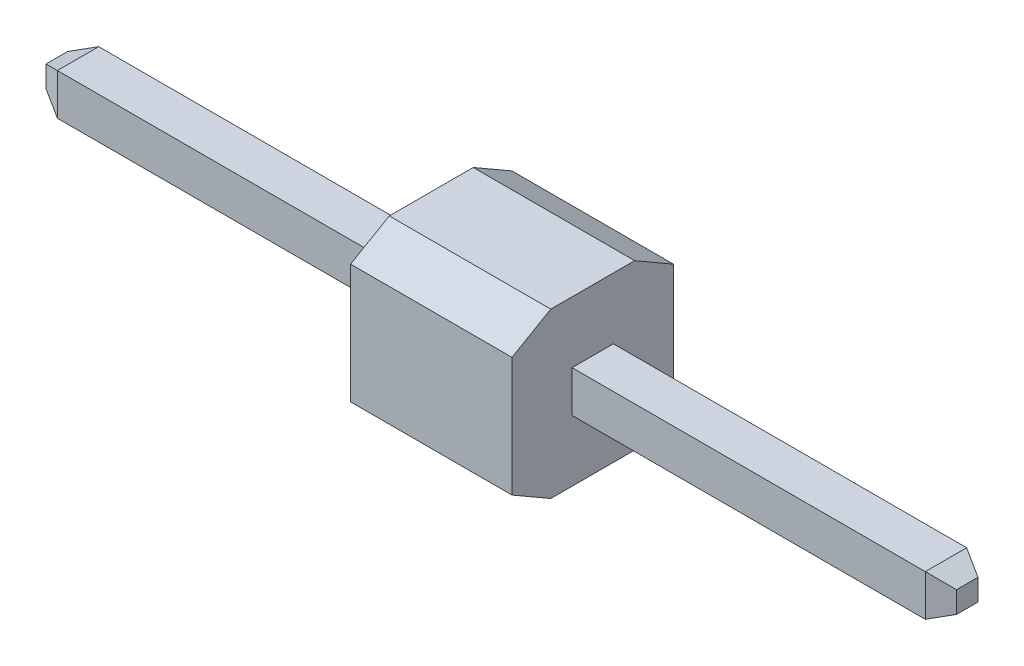
ISO-10303-21;
HEADER;
FILE_DESCRIPTION(('STEP AP214'),'2;1');
FILE_NAME('part.step','',(''),(''),'','','');
FILE_SCHEMA(('AUTOMOTIVE_DESIGN { 1 0 10303 214 1 1 1 1 }'));
ENDSEC;
DATA;
#1=APPLICATION_CONTEXT('core data for automotive mechanical design processes');
#2=APPLICATION_PROTOCOL_DEFINITION('international standard','automotive_design',2000,#1);
#3=PRODUCT_CONTEXT('',#1,'mechanical');
#4=PRODUCT('Part','Part','',(#3));
#5=PRODUCT_RELATED_PRODUCT_CATEGORY('part','',(#4));
#6=PRODUCT_DEFINITION_FORMATION('','',#4);
#7=PRODUCT_DEFINITION_CONTEXT('part definition',#1,'design');
#8=PRODUCT_DEFINITION('design','',#6,#7);
#9=PRODUCT_DEFINITION_SHAPE('','',#8);
#10=(LENGTH_UNIT() NAMED_UNIT(*) SI_UNIT(.MILLI.,.METRE.));
#11=(NAMED_UNIT(*) PLANE_ANGLE_UNIT() SI_UNIT($,.RADIAN.));
#12=(NAMED_UNIT(*) SI_UNIT($,.STERADIAN.) SOLID_ANGLE_UNIT());
#13=UNCERTAINTY_MEASURE_WITH_UNIT(LENGTH_MEASURE(1.E-05),#10,'distance_accuracy_value','');
#14=(GEOMETRIC_REPRESENTATION_CONTEXT(3) GLOBAL_UNCERTAINTY_ASSIGNED_CONTEXT((#13)) GLOBAL_UNIT_ASSIGNED_CONTEXT((#10,
#11,#12)) REPRESENTATION_CONTEXT('',''));
#15=CARTESIAN_POINT('',(0.,0.,0.));
#16=DIRECTION('',(0.,0.,1.));
#17=DIRECTION('',(1.,0.,0.));
#18=AXIS2_PLACEMENT_3D('',#15,#16,#17);
#19=CARTESIAN_POINT('',(5.42110044765887,0.317115726057139,-2.77112059556477));
#20=DIRECTION('',(1.,-9.93476518829084E-08,4.37113882867379E-08));
#21=DIRECTION('',(-9.93476589883358E-08,-1.,8.74227765734759E-08));
#22=AXIS2_PLACEMENT_3D('',#19,#20,#21);
#23=PLANE('',#22);
#24=DIRECTION('',(-1.18186632779335E-08,-0.50000007571054,-0.866025360072934));
#25=VECTOR('',#24,1.);
#26=CARTESIAN_POINT('',(5.42110025548426,-0.926473975179089,-1.20112048684669));
#27=LINE('',#26,#25);
#28=CARTESIAN_POINT('',(5.42110025548426,-0.926473975179089,-1.20112048684669));
#29=VERTEX_POINT('',#28);
#30=CARTESIAN_POINT('',(5.42110024729606,-1.27288418914276,-1.80112045656255));
#31=VERTEX_POINT('',#30);
#32=EDGE_CURVE('E11',#29,#31,#27,.T.);
#33=ORIENTED_EDGE('',*,*,#32,.T.);
#34=DIRECTION('',(4.37113811813104E-08,-8.74227828590458E-08,-0.999999999999995));
#35=VECTOR('',#34,1.);
#36=CARTESIAN_POINT('',(5.42110024729606,-1.27288418914276,-1.80112045656255));
#37=LINE('',#36,#35);
#38=CARTESIAN_POINT('',(5.42110030412085,-1.27288430279238,-3.10112045656255));
#39=VERTEX_POINT('',#38);
#40=EDGE_CURVE('E304',#31,#39,#37,.T.);
#41=ORIENTED_EDGE('',*,*,#40,.T.);
#42=DIRECTION('',(8.75289963531794E-08,0.499999924289837,-0.866025447495713));
#43=VECTOR('',#42,1.);
#44=CARTESIAN_POINT('',(5.42110030412085,-1.27288430279238,-3.10112045656255));
#45=LINE('',#44,#43);
#46=CARTESIAN_POINT('',(5.42110036476272,-0.926474193736048,-3.70112048684669));
#47=VERTEX_POINT('',#46);
#48=EDGE_CURVE('E296',#39,#47,#45,.T.);
#49=ORIENTED_EDGE('',*,*,#48,.T.);
#50=DIRECTION('',(9.93476588436478E-08,0.999999999999991,-8.74227767226935E-08));
#51=VECTOR('',#50,1.);
#52=CARTESIAN_POINT('',(5.42110036476272,-0.926474193736048,-3.70112048684669));
#53=LINE('',#52,#51);
#54=CARTESIAN_POINT('',(5.42110054827569,0.920705483233952,-3.70112064833227));
#55=VERTEX_POINT('',#54);
#56=EDGE_CURVE('E281',#47,#55,#53,.T.);
#57=ORIENTED_EDGE('',*,*,#56,.T.);
#58=DIRECTION('',(-1.18186632778483E-08,-0.500000075710537,-0.866025360072935));
#59=VECTOR('',#58,1.);
#60=CARTESIAN_POINT('',(5.4211005564639,1.26711569720762,-3.1011206786164));
#61=LINE('',#60,#59);
#62=CARTESIAN_POINT('',(5.4211005564639,1.26711569720762,-3.1011206786164));
#63=VERTEX_POINT('',#62);
#64=EDGE_CURVE('E265',#63,#55,#61,.T.);
#65=ORIENTED_EDGE('',*,*,#64,.F.);
#66=DIRECTION('',(4.37113811813104E-08,-8.74227828590458E-08,-0.999999999999995));
#67=VECTOR('',#66,1.);
#68=CARTESIAN_POINT('',(5.42110049963911,1.26711581085724,-1.8011206786164));
#69=LINE('',#68,#67);
#70=CARTESIAN_POINT('',(5.42110049963911,1.26711581085724,-1.8011206786164));
#71=VERTEX_POINT('',#70);
#72=EDGE_CURVE('E248',#71,#63,#69,.T.);
#73=ORIENTED_EDGE('',*,*,#72,.F.);
#74=DIRECTION('',(8.75289963525479E-08,0.499999924289836,-0.866025447495713));
#75=VECTOR('',#74,1.);
#76=CARTESIAN_POINT('',(5.42110043899724,0.920705701790911,-1.20112064833227));
#77=LINE('',#76,#75);
#78=CARTESIAN_POINT('',(5.42110043899724,0.920705701790911,-1.20112064833227));
#79=VERTEX_POINT('',#78);
#80=EDGE_CURVE('E242',#79,#71,#77,.T.);
#81=ORIENTED_EDGE('',*,*,#80,.F.);
#82=DIRECTION('',(9.93476588436478E-08,0.999999999999991,-8.7422776241864E-08));
#83=VECTOR('',#82,1.);
#84=CARTESIAN_POINT('',(5.42110025548426,-0.926473975179089,-1.20112048684669));
#85=LINE('',#84,#83);
#86=EDGE_CURVE('E236',#29,#79,#85,.T.);
#87=ORIENTED_EDGE('',*,*,#86,.F.);
#88=EDGE_LOOP('',(#33,#41,#49,#57,#65,#73,#81,#87));
#89=FACE_BOUND('',#88,.T.);
#90=DIRECTION('',(-4.37113803486431E-08,8.74227829017466E-08,0.999999999999995));
#91=VECTOR('',#90,1.);
#92=CARTESIAN_POINT('',(5.42110038407637,-0.32288427394286,-2.77112053961419));
#93=LINE('',#92,#91);
#94=CARTESIAN_POINT('',(5.42110038407637,-0.32288427394286,-2.77112053961419));
#95=VERTEX_POINT('',#94);
#96=CARTESIAN_POINT('',(5.42110035610109,-0.322884217992279,-2.13112053961419));
#97=VERTEX_POINT('',#96);
#98=EDGE_CURVE('E302',#95,#97,#93,.T.);
#99=ORIENTED_EDGE('',*,*,#98,.T.);
#100=DIRECTION('',(-9.93476578781121E-08,-0.999999999999991,8.7422776656742E-08));
#101=VECTOR('',#100,1.);
#102=CARTESIAN_POINT('',(5.42110041968359,0.31711578200772,-2.13112059556477));
#103=LINE('',#102,#101);
#104=CARTESIAN_POINT('',(5.42110041968359,0.31711578200772,-2.13112059556477));
#105=VERTEX_POINT('',#104);
#106=EDGE_CURVE('E293',#105,#97,#103,.T.);
#107=ORIENTED_EDGE('',*,*,#106,.F.);
#108=DIRECTION('',(-4.37113817364219E-08,8.74227829017467E-08,0.999999999999995));
#109=VECTOR('',#108,1.);
#110=CARTESIAN_POINT('',(5.42110044765887,0.317115726057139,-2.77112059556477));
#111=LINE('',#110,#109);
#112=CARTESIAN_POINT('',(5.42110044765887,0.317115726057139,-2.77112059556477));
#113=VERTEX_POINT('',#112);
#114=EDGE_CURVE('E278',#113,#105,#111,.T.);
#115=ORIENTED_EDGE('',*,*,#114,.F.);
#116=DIRECTION('',(-9.93476592658908E-08,-0.999999999999991,8.74227759628526E-08));
#117=VECTOR('',#116,1.);
#118=CARTESIAN_POINT('',(5.42110044765887,0.317115726057139,-2.77112059556477));
#119=LINE('',#118,#117);
#120=EDGE_CURVE('E263',#113,#95,#119,.T.);
#121=ORIENTED_EDGE('',*,*,#120,.T.);
#122=EDGE_LOOP('',(#99,#107,#115,#121));
#123=FACE_BOUND('',#122,.T.);
#124=ADVANCED_FACE('F17',(#89,#123),#23,.T.);
#125=CARTESIAN_POINT('',(2.92110044765887,0.317115974426269,-2.77112070484324));
#126=DIRECTION('',(1.,-9.93476518829084E-08,4.37113882867379E-08));
#127=DIRECTION('',(-9.93476589883358E-08,-1.,8.74227765734759E-08));
#128=AXIS2_PLACEMENT_3D('',#125,#126,#127);
#129=PLANE('',#128);
#130=DIRECTION('',(-1.1818662636946E-08,-0.50000007571054,-0.866025360072934));
#131=VECTOR('',#130,1.);
#132=CARTESIAN_POINT('',(2.92110025548427,-0.926473726809959,-1.20112059612516));
#133=LINE('',#132,#131);
#134=CARTESIAN_POINT('',(2.92110025548427,-0.926473726809959,-1.20112059612516));
#135=VERTEX_POINT('',#134);
#136=CARTESIAN_POINT('',(2.92110024729606,-1.27288394077363,-1.80112056584102));
#137=VERTEX_POINT('',#136);
#138=EDGE_CURVE('E24',#135,#137,#133,.T.);
#139=ORIENTED_EDGE('',*,*,#138,.F.);
#140=DIRECTION('',(9.93476590840625E-08,0.999999999999991,-8.7422776241864E-08));
#141=VECTOR('',#140,1.);
#142=CARTESIAN_POINT('',(2.92110025548427,-0.926473726809959,-1.20112059612516));
#143=LINE('',#142,#141);
#144=CARTESIAN_POINT('',(2.92110043899724,0.920705950160041,-1.20112075761074));
#145=VERTEX_POINT('',#144);
#146=EDGE_CURVE('E300',#135,#145,#143,.T.);
#147=ORIENTED_EDGE('',*,*,#146,.T.);
#148=DIRECTION('',(8.75289957115603E-08,0.499999924289836,-0.866025447495713));
#149=VECTOR('',#148,1.);
#150=CARTESIAN_POINT('',(2.92110043899724,0.920705950160041,-1.20112075761074));
#151=LINE('',#150,#149);
#152=CARTESIAN_POINT('',(2.92110049963911,1.26711605922637,-1.80112078789487));
#153=VERTEX_POINT('',#152);
#154=EDGE_CURVE('E286',#145,#153,#151,.T.);
#155=ORIENTED_EDGE('',*,*,#154,.T.);
#156=DIRECTION('',(4.37113811813104E-08,-8.74227828590458E-08,-0.999999999999995));
#157=VECTOR('',#156,1.);
#158=CARTESIAN_POINT('',(2.92110049963911,1.26711605922637,-1.80112078789487));
#159=LINE('',#158,#157);
#160=CARTESIAN_POINT('',(2.9211005564639,1.26711594557675,-3.10112078789487));
#161=VERTEX_POINT('',#160);
#162=EDGE_CURVE('E271',#153,#161,#159,.T.);
#163=ORIENTED_EDGE('',*,*,#162,.T.);
#164=DIRECTION('',(-1.18186626368607E-08,-0.500000075710537,-0.866025360072935));
#165=VECTOR('',#164,1.);
#166=CARTESIAN_POINT('',(2.9211005564639,1.26711594557675,-3.10112078789487));
#167=LINE('',#166,#165);
#168=CARTESIAN_POINT('',(2.92110054827569,0.920705731603082,-3.70112075761074));
#169=VERTEX_POINT('',#168);
#170=EDGE_CURVE('E253',#161,#169,#167,.T.);
#171=ORIENTED_EDGE('',*,*,#170,.T.);
#172=DIRECTION('',(9.93476590840625E-08,0.999999999999991,-8.74227767226935E-08));
#173=VECTOR('',#172,1.);
#174=CARTESIAN_POINT('',(2.92110036476272,-0.926473945366919,-3.70112059612516));
#175=LINE('',#174,#173);
#176=CARTESIAN_POINT('',(2.92110036476272,-0.926473945366919,-3.70112059612516));
#177=VERTEX_POINT('',#176);
#178=EDGE_CURVE('E261',#177,#169,#175,.T.);
#179=ORIENTED_EDGE('',*,*,#178,.F.);
#180=DIRECTION('',(8.75289957121919E-08,0.499999924289837,-0.866025447495713));
#181=VECTOR('',#180,1.);
#182=CARTESIAN_POINT('',(2.92110030412085,-1.27288405442325,-3.10112056584102));
#183=LINE('',#182,#181);
#184=CARTESIAN_POINT('',(2.92110030412085,-1.27288405442325,-3.10112056584102));
#185=VERTEX_POINT('',#184);
#186=EDGE_CURVE('E276',#185,#177,#183,.T.);
#187=ORIENTED_EDGE('',*,*,#186,.F.);
#188=DIRECTION('',(4.37113811813104E-08,-8.74227828590458E-08,-0.999999999999995));
#189=VECTOR('',#188,1.);
#190=CARTESIAN_POINT('',(2.92110024729606,-1.27288394077363,-1.80112056584102));
#191=LINE('',#190,#189);
#192=EDGE_CURVE('E291',#137,#185,#191,.T.);
#193=ORIENTED_EDGE('',*,*,#192,.F.);
#194=EDGE_LOOP('',(#139,#147,#155,#163,#171,#179,#187,#193));
#195=FACE_BOUND('',#194,.T.);
#196=DIRECTION('',(-9.93476592658908E-08,-0.999999999999991,8.7422776656742E-08));
#197=VECTOR('',#196,1.);
#198=CARTESIAN_POINT('',(2.92110041968359,0.31711603037685,-2.13112070484324));
#199=LINE('',#198,#197);
#200=CARTESIAN_POINT('',(2.92110041968359,0.31711603037685,-2.13112070484324));
#201=VERTEX_POINT('',#200);
#202=CARTESIAN_POINT('',(2.92110035610109,-0.322883969623149,-2.13112064889266));
#203=VERTEX_POINT('',#202);
#204=EDGE_CURVE('E298',#201,#203,#199,.T.);
#205=ORIENTED_EDGE('',*,*,#204,.T.);
#206=DIRECTION('',(-4.37113810425325E-08,8.74227829017466E-08,0.999999999999995));
#207=VECTOR('',#206,1.);
#208=CARTESIAN_POINT('',(2.92110038407637,-0.32288402557373,-2.77112064889266));
#209=LINE('',#208,#207);
#210=CARTESIAN_POINT('',(2.92110038407637,-0.32288402557373,-2.77112064889266));
#211=VERTEX_POINT('',#210);
#212=EDGE_CURVE('E283',#211,#203,#209,.T.);
#213=ORIENTED_EDGE('',*,*,#212,.F.);
#214=DIRECTION('',(-9.93476592658908E-08,-0.999999999999991,8.74227759628526E-08));
#215=VECTOR('',#214,1.);
#216=CARTESIAN_POINT('',(2.92110044765887,0.317115974426269,-2.77112070484324));
#217=LINE('',#216,#215);
#218=CARTESIAN_POINT('',(2.92110044765887,0.317115974426269,-2.77112070484324));
#219=VERTEX_POINT('',#218);
#220=EDGE_CURVE('E268',#219,#211,#217,.T.);
#221=ORIENTED_EDGE('',*,*,#220,.F.);
#222=DIRECTION('',(-4.37113810425325E-08,8.74227829017467E-08,0.999999999999995));
#223=VECTOR('',#222,1.);
#224=CARTESIAN_POINT('',(2.92110044765887,0.317115974426269,-2.77112070484324));
#225=LINE('',#224,#223);
#226=EDGE_CURVE('E251',#219,#201,#225,.T.);
#227=ORIENTED_EDGE('',*,*,#226,.T.);
#228=EDGE_LOOP('',(#205,#213,#221,#227));
#229=FACE_BOUND('',#228,.T.);
#230=ADVANCED_FACE('F314',(#195,#229),#129,.F.);
#231=CARTESIAN_POINT('',(5.42110025548426,-0.926473975179089,-1.20112048684669));
#232=DIRECTION('',(1.07893287081065E-07,0.866025360072937,-0.500000075710535));
#233=DIRECTION('',(1.18186629566715E-08,0.500000075710542,0.866025360072941));
#234=AXIS2_PLACEMENT_3D('',#231,#232,#233);
#235=PLANE('',#234);
#236=ORIENTED_EDGE('',*,*,#138,.T.);
#237=DIRECTION('',(-0.999999999999994,9.93476518829078E-08,-4.37113883755555E-08));
#238=VECTOR('',#237,1.);
#239=CARTESIAN_POINT('',(5.42110024729606,-1.27288418914276,-1.80112045656255));
#240=LINE('',#239,#238);
#241=EDGE_CURVE('E288',#31,#137,#240,.T.);
#242=ORIENTED_EDGE('',*,*,#241,.F.);
#243=ORIENTED_EDGE('',*,*,#32,.F.);
#244=DIRECTION('',(-0.999999999999994,9.93476518829078E-08,-4.3711388109102E-08));
#245=VECTOR('',#244,1.);
#246=CARTESIAN_POINT('',(5.42110025548426,-0.926473975179089,-1.20112048684669));
#247=LINE('',#246,#245);
#248=EDGE_CURVE('E256',#29,#135,#247,.T.);
#249=ORIENTED_EDGE('',*,*,#248,.T.);
#250=EDGE_LOOP('',(#236,#242,#243,#249));
#251=FACE_BOUND('',#250,.T.);
#252=ADVANCED_FACE('F306',(#251),#235,.F.);
#253=CARTESIAN_POINT('',(5.42110024729606,-1.27288418914276,-1.80112045656255));
#254=DIRECTION('',(9.93476589883358E-08,1.,-8.74227765734759E-08));
#255=DIRECTION('',(1.,-9.93476518829084E-08,4.37113882867379E-08));
#256=AXIS2_PLACEMENT_3D('',#253,#254,#255);
#257=PLANE('',#256);
#258=ORIENTED_EDGE('',*,*,#192,.T.);
#259=DIRECTION('',(-0.999999999999994,9.93476518829078E-08,-4.37113882867377E-08));
#260=VECTOR('',#259,1.);
#261=CARTESIAN_POINT('',(5.42110030412085,-1.27288430279238,-3.10112045656255));
#262=LINE('',#261,#260);
#263=EDGE_CURVE('E273',#39,#185,#262,.T.);
#264=ORIENTED_EDGE('',*,*,#263,.F.);
#265=ORIENTED_EDGE('',*,*,#40,.F.);
#266=ORIENTED_EDGE('',*,*,#241,.T.);
#267=EDGE_LOOP('',(#258,#264,#265,#266));
#268=FACE_BOUND('',#267,.T.);
#269=ADVANCED_FACE('F311',(#268),#257,.F.);
#270=CARTESIAN_POINT('',(5.42110030412085,-1.27288430279238,-3.10112045656255));
#271=DIRECTION('',(6.41819058997377E-08,0.866025447495721,0.499999924289845));
#272=DIRECTION('',(-8.7528996031702E-08,-0.499999924289838,0.866025447495717));
#273=AXIS2_PLACEMENT_3D('',#270,#271,#272);
#274=PLANE('',#273);
#275=ORIENTED_EDGE('',*,*,#186,.T.);
#276=DIRECTION('',(-0.999999999999994,9.93476518829078E-08,-4.37113884643734E-08));
#277=VECTOR('',#276,1.);
#278=CARTESIAN_POINT('',(5.42110036476272,-0.926474193736048,-3.70112048684669));
#279=LINE('',#278,#277);
#280=EDGE_CURVE('E258',#47,#177,#279,.T.);
#281=ORIENTED_EDGE('',*,*,#280,.F.);
#282=ORIENTED_EDGE('',*,*,#48,.F.);
#283=ORIENTED_EDGE('',*,*,#263,.T.);
#284=EDGE_LOOP('',(#275,#281,#282,#283));
#285=FACE_BOUND('',#284,.T.);
#286=ADVANCED_FACE('F319',(#285),#274,.F.);
#287=CARTESIAN_POINT('',(5.42110036476272,-0.926474193736048,-3.70112048684669));
#288=DIRECTION('',(-4.37113811813106E-08,8.74227836789032E-08,1.));
#289=DIRECTION('',(-1.,9.93476518829084E-08,-4.37113882867379E-08));
#290=AXIS2_PLACEMENT_3D('',#287,#288,#289);
#291=PLANE('',#290);
#292=ORIENTED_EDGE('',*,*,#178,.T.);
#293=DIRECTION('',(-0.999999999999994,9.93476533039933E-08,-4.37113882867377E-08));
#294=VECTOR('',#293,1.);
#295=CARTESIAN_POINT('',(5.42110054827569,0.920705483233952,-3.70112064833227));
#296=LINE('',#295,#294);
#297=EDGE_CURVE('E245',#55,#169,#296,.T.);
#298=ORIENTED_EDGE('',*,*,#297,.F.);
#299=ORIENTED_EDGE('',*,*,#56,.F.);
#300=ORIENTED_EDGE('',*,*,#280,.T.);
#301=EDGE_LOOP('',(#292,#298,#299,#300));
#302=FACE_BOUND('',#301,.T.);
#303=ADVANCED_FACE('F326',(#302),#291,.F.);
#304=CARTESIAN_POINT('',(5.4211005564639,1.26711569720762,-3.1011206786164));
#305=DIRECTION('',(1.07893287081065E-07,0.866025360072937,-0.500000075710535));
#306=DIRECTION('',(1.18186629566715E-08,0.500000075710542,0.866025360072941));
#307=AXIS2_PLACEMENT_3D('',#304,#305,#306);
#308=PLANE('',#307);
#309=ORIENTED_EDGE('',*,*,#170,.F.);
#310=DIRECTION('',(-0.999999999999994,9.93476511723651E-08,-4.37113882867377E-08));
#311=VECTOR('',#310,1.);
#312=CARTESIAN_POINT('',(5.4211005564639,1.26711569720762,-3.1011206786164));
#313=LINE('',#312,#311);
#314=EDGE_CURVE('E239',#63,#161,#313,.T.);
#315=ORIENTED_EDGE('',*,*,#314,.F.);
#316=ORIENTED_EDGE('',*,*,#64,.T.);
#317=ORIENTED_EDGE('',*,*,#297,.T.);
#318=EDGE_LOOP('',(#309,#315,#316,#317));
#319=FACE_BOUND('',#318,.T.);
#320=ADVANCED_FACE('F329',(#319),#308,.T.);
#321=CARTESIAN_POINT('',(5.42110049963911,1.26711581085724,-1.8011206786164));
#322=DIRECTION('',(9.93476589883358E-08,1.,-8.74227765734759E-08));
#323=DIRECTION('',(1.,-9.93476518829084E-08,4.37113882867379E-08));
#324=AXIS2_PLACEMENT_3D('',#321,#322,#323);
#325=PLANE('',#324);
#326=ORIENTED_EDGE('',*,*,#162,.F.);
#327=DIRECTION('',(-0.999999999999994,9.93476511723651E-08,-4.37113884643734E-08));
#328=VECTOR('',#327,1.);
#329=CARTESIAN_POINT('',(5.42110049963911,1.26711581085724,-1.8011206786164));
#330=LINE('',#329,#328);
#331=EDGE_CURVE('E233',#71,#153,#330,.T.);
#332=ORIENTED_EDGE('',*,*,#331,.F.);
#333=ORIENTED_EDGE('',*,*,#72,.T.);
#334=ORIENTED_EDGE('',*,*,#314,.T.);
#335=EDGE_LOOP('',(#326,#332,#333,#334));
#336=FACE_BOUND('',#335,.T.);
#337=ADVANCED_FACE('F333',(#336),#325,.T.);
#338=CARTESIAN_POINT('',(5.42110043899724,0.920705701790911,-1.20112064833227));
#339=DIRECTION('',(6.41819058997377E-08,0.866025447495721,0.499999924289845));
#340=DIRECTION('',(-8.7528996031702E-08,-0.499999924289838,0.866025447495717));
#341=AXIS2_PLACEMENT_3D('',#338,#339,#340);
#342=PLANE('',#341);
#343=ORIENTED_EDGE('',*,*,#154,.F.);
#344=DIRECTION('',(-0.999999999999994,9.93476533039933E-08,-4.3711388109102E-08));
#345=VECTOR('',#344,1.);
#346=CARTESIAN_POINT('',(5.42110043899724,0.920705701790911,-1.20112064833227));
#347=LINE('',#346,#345);
#348=EDGE_CURVE('E230',#79,#145,#347,.T.);
#349=ORIENTED_EDGE('',*,*,#348,.F.);
#350=ORIENTED_EDGE('',*,*,#80,.T.);
#351=ORIENTED_EDGE('',*,*,#331,.T.);
#352=EDGE_LOOP('',(#343,#349,#350,#351));
#353=FACE_BOUND('',#352,.T.);
#354=ADVANCED_FACE('F337',(#353),#342,.T.);
#355=CARTESIAN_POINT('',(5.42110025548426,-0.926473975179089,-1.20112048684669));
#356=DIRECTION('',(-4.37113811813106E-08,8.74227835615132E-08,1.));
#357=DIRECTION('',(-9.93476589883358E-08,-1.,8.74227764560859E-08));
#358=AXIS2_PLACEMENT_3D('',#355,#356,#357);
#359=PLANE('',#358);
#360=ORIENTED_EDGE('',*,*,#146,.F.);
#361=ORIENTED_EDGE('',*,*,#248,.F.);
#362=ORIENTED_EDGE('',*,*,#86,.T.);
#363=ORIENTED_EDGE('',*,*,#348,.T.);
#364=EDGE_LOOP('',(#360,#361,#362,#363));
#365=FACE_BOUND('',#364,.T.);
#366=ADVANCED_FACE('F339',(#365),#359,.T.);
#367=CARTESIAN_POINT('',(-2.87889955234113,0.31711655064265,-2.77112095836929));
#368=DIRECTION('',(-1.,9.93476518829084E-08,-4.37113882867379E-08));
#369=DIRECTION('',(9.93476589883358E-08,1.,-8.74227765734759E-08));
#370=AXIS2_PLACEMENT_3D('',#367,#368,#369);
#371=PLANE('',#370);
#372=DIRECTION('',(9.93476608211201E-08,0.999999999999991,-8.7422776141512E-08));
#373=VECTOR('',#372,1.);
#374=CARTESIAN_POINT('',(-2.87889962188477,-0.169001879669519,-2.28500244306246));
#375=LINE('',#374,#373);
#376=CARTESIAN_POINT('',(-2.87889962188477,-0.169001879669519,-2.28500244306246));
#377=VERTEX_POINT('',#376);
#378=CARTESIAN_POINT('',(-2.87889958887781,0.16323506594048,-2.28500247210754));
#379=VERTEX_POINT('',#378);
#380=EDGE_CURVE('E228',#377,#379,#375,.T.);
#381=ORIENTED_EDGE('',*,*,#380,.T.);
#382=DIRECTION('',(4.37113820547149E-08,-8.74227801493995E-08,-0.999999999999995));
#383=VECTOR('',#382,1.);
#384=CARTESIAN_POINT('',(-2.87889958887781,0.16323506594048,-2.28500247210754));
#385=LINE('',#384,#383);
#386=CARTESIAN_POINT('',(-2.87889957435527,0.163235036895403,-2.61723941772554));
#387=VERTEX_POINT('',#386);
#388=EDGE_CURVE('E223',#379,#387,#385,.T.);
#389=ORIENTED_EDGE('',*,*,#388,.T.);
#390=DIRECTION('',(-9.93476581477913E-08,-0.999999999999991,8.74227761415115E-08));
#391=VECTOR('',#390,1.);
#392=CARTESIAN_POINT('',(-2.87889957435527,0.163235036895404,-2.61723941772554));
#393=LINE('',#392,#391);
#394=CARTESIAN_POINT('',(-2.87889960736223,-0.169001908714597,-2.61723938868046));
#395=VERTEX_POINT('',#394);
#396=EDGE_CURVE('E215',#387,#395,#393,.T.);
#397=ORIENTED_EDGE('',*,*,#396,.T.);
#398=DIRECTION('',(-4.37113740347301E-08,8.7422774802743E-08,0.999999999999995));
#399=VECTOR('',#398,1.);
#400=CARTESIAN_POINT('',(-2.87889960736224,-0.169001908714597,-2.61723938868046));
#401=LINE('',#400,#399);
#402=EDGE_CURVE('E207',#395,#377,#401,.T.);
#403=ORIENTED_EDGE('',*,*,#402,.T.);
#404=EDGE_LOOP('',(#381,#389,#397,#403));
#405=FACE_BOUND('',#404,.T.);
#406=ADVANCED_FACE('F341',(#405),#371,.T.);
#407=CARTESIAN_POINT('',(-2.87889955234113,0.31711655064265,-2.77112095836929));
#408=DIRECTION('',(9.93476589883358E-08,1.,-8.74227764510112E-08));
#409=DIRECTION('',(-4.37113811813106E-08,8.74227835564385E-08,1.));
#410=AXIS2_PLACEMENT_3D('',#407,#408,#409);
#411=PLANE('',#410);
#412=DIRECTION('',(0.999999999999994,-9.93476511294987E-08,4.37113883581816E-08));
#413=VECTOR('',#412,1.);
#414=CARTESIAN_POINT('',(-2.54889955234113,0.317116517857924,-2.77112094394453));
#415=LINE('',#414,#413);
#416=CARTESIAN_POINT('',(-2.54889955234113,0.317116517857924,-2.77112094394453));
#417=VERTEX_POINT('',#416);
#418=EDGE_CURVE('E225',#417,#219,#415,.T.);
#419=ORIENTED_EDGE('',*,*,#418,.F.);
#420=DIRECTION('',(-4.37113817364219E-08,8.74227829017466E-08,0.999999999999995));
#421=VECTOR('',#420,1.);
#422=CARTESIAN_POINT('',(-2.54889955234113,0.317116517857924,-2.77112094394453));
#423=LINE('',#422,#421);
#424=CARTESIAN_POINT('',(-2.54889958031641,0.317116573808505,-2.13112094394453));
#425=VERTEX_POINT('',#424);
#426=EDGE_CURVE('E217',#417,#425,#423,.T.);
#427=ORIENTED_EDGE('',*,*,#426,.T.);
#428=DIRECTION('',(0.999999999999994,-9.93476511294987E-08,4.37113882769953E-08));
#429=VECTOR('',#428,1.);
#430=CARTESIAN_POINT('',(-2.54889958031641,0.317116573808505,-2.13112094394453));
#431=LINE('',#430,#429);
#432=EDGE_CURVE('E220',#425,#201,#431,.T.);
#433=ORIENTED_EDGE('',*,*,#432,.T.);
#434=ORIENTED_EDGE('',*,*,#226,.F.);
#435=EDGE_LOOP('',(#419,#427,#433,#434));
#436=FACE_BOUND('',#435,.T.);
#437=ADVANCED_FACE('F348',(#436),#411,.T.);
#438=CARTESIAN_POINT('',(-2.87889958031641,0.317116606593231,-2.13112095836929));
#439=DIRECTION('',(-4.37113811813106E-08,8.74227836789032E-08,1.));
#440=DIRECTION('',(-1.,9.93476518829084E-08,-4.37113882867379E-08));
#441=AXIS2_PLACEMENT_3D('',#438,#439,#440);
#442=PLANE('',#441);
#443=ORIENTED_EDGE('',*,*,#432,.F.);
#444=DIRECTION('',(-9.93476578781121E-08,-0.999999999999991,8.7422776656742E-08));
#445=VECTOR('',#444,1.);
#446=CARTESIAN_POINT('',(-2.54889958031641,0.317116573808505,-2.13112094394453));
#447=LINE('',#446,#445);
#448=CARTESIAN_POINT('',(-2.54889964389891,-0.322883426191494,-2.13112088799395));
#449=VERTEX_POINT('',#448);
#450=EDGE_CURVE('E209',#425,#449,#447,.T.);
#451=ORIENTED_EDGE('',*,*,#450,.T.);
#452=DIRECTION('',(0.999999999999994,-9.93476501552628E-08,4.3711388195809E-08));
#453=VECTOR('',#452,1.);
#454=CARTESIAN_POINT('',(-2.54889964389891,-0.322883426191494,-2.13112088799395));
#455=LINE('',#454,#453);
#456=EDGE_CURVE('E212',#449,#203,#455,.T.);
#457=ORIENTED_EDGE('',*,*,#456,.T.);
#458=ORIENTED_EDGE('',*,*,#204,.F.);
#459=EDGE_LOOP('',(#443,#451,#457,#458));
#460=FACE_BOUND('',#459,.T.);
#461=ADVANCED_FACE('F424',(#460),#442,.T.);
#462=CARTESIAN_POINT('',(-2.87889961592363,-0.322883449357349,-2.77112090241871));
#463=DIRECTION('',(9.93476589883357E-08,1.,-8.74227764040693E-08));
#464=DIRECTION('',(-4.37113811813106E-08,8.74227835094966E-08,1.));
#465=AXIS2_PLACEMENT_3D('',#462,#463,#464);
#466=PLANE('',#465);
#467=ORIENTED_EDGE('',*,*,#456,.F.);
#468=DIRECTION('',(4.37113817364219E-08,-8.74227829017466E-08,-0.999999999999995));
#469=VECTOR('',#468,1.);
#470=CARTESIAN_POINT('',(-2.54889964389891,-0.322883426191494,-2.13112088799395));
#471=LINE('',#470,#469);
#472=CARTESIAN_POINT('',(-2.54889961592363,-0.322883482142075,-2.77112088799395));
#473=VERTEX_POINT('',#472);
#474=EDGE_CURVE('E201',#449,#473,#471,.T.);
#475=ORIENTED_EDGE('',*,*,#474,.T.);
#476=DIRECTION('',(0.999999999999994,-9.93476501552628E-08,4.37113882769953E-08));
#477=VECTOR('',#476,1.);
#478=CARTESIAN_POINT('',(-2.54889961592363,-0.322883482142075,-2.77112088799395));
#479=LINE('',#478,#477);
#480=EDGE_CURVE('E204',#473,#211,#479,.T.);
#481=ORIENTED_EDGE('',*,*,#480,.T.);
#482=ORIENTED_EDGE('',*,*,#212,.T.);
#483=EDGE_LOOP('',(#467,#475,#481,#482));
#484=FACE_BOUND('',#483,.T.);
#485=ADVANCED_FACE('F421',(#484),#466,.F.);
#486=CARTESIAN_POINT('',(-2.87889955234113,0.31711655064265,-2.77112095836929));
#487=DIRECTION('',(-4.37113811813106E-08,8.74227836789032E-08,1.));
#488=DIRECTION('',(-1.,9.93476518829084E-08,-4.37113882867379E-08));
#489=AXIS2_PLACEMENT_3D('',#486,#487,#488);
#490=PLANE('',#489);
#491=ORIENTED_EDGE('',*,*,#480,.F.);
#492=DIRECTION('',(9.93476606536699E-08,0.999999999999991,-8.74227766567422E-08));
#493=VECTOR('',#492,1.);
#494=CARTESIAN_POINT('',(-2.54889961592363,-0.322883482142073,-2.77112088799395));
#495=LINE('',#494,#493);
#496=EDGE_CURVE('E196',#473,#417,#495,.T.);
#497=ORIENTED_EDGE('',*,*,#496,.T.);
#498=ORIENTED_EDGE('',*,*,#418,.T.);
#499=ORIENTED_EDGE('',*,*,#220,.T.);
#500=EDGE_LOOP('',(#491,#497,#498,#499));
#501=FACE_BOUND('',#500,.T.);
#502=ADVANCED_FACE('F376',(#501),#490,.F.);
#503=CARTESIAN_POINT('',(-2.87889955234113,0.31711655064265,-2.77112095836929));
#504=DIRECTION('',(-4.37113811813106E-08,8.74227836789032E-08,1.));
#505=DIRECTION('',(-1.,9.93476518829084E-08,-4.37113882867379E-08));
#506=AXIS2_PLACEMENT_3D('',#503,#504,#505);
#507=PLANE('',#506);
#508=DIRECTION('',(0.999999999999994,-9.93476465830644E-08,4.37113882769953E-08));
#509=VECTOR('',#508,1.);
#510=CARTESIAN_POINT('',(5.42110044765887,0.317115726057128,-2.77112059556477));
#511=LINE('',#510,#509);
#512=CARTESIAN_POINT('',(10.8911004476589,0.317115182625484,-2.77112035646347));
#513=VERTEX_POINT('',#512);
#514=EDGE_CURVE('E199',#113,#513,#511,.T.);
#515=ORIENTED_EDGE('',*,*,#514,.T.);
#516=DIRECTION('',(-9.93476578781121E-08,-0.999999999999991,8.7422776656742E-08));
#517=VECTOR('',#516,1.);
#518=CARTESIAN_POINT('',(10.8911004476589,0.317115182625484,-2.77112035646347));
#519=LINE('',#518,#517);
#520=CARTESIAN_POINT('',(10.8911003840764,-0.322884817374515,-2.7711203005129));
#521=VERTEX_POINT('',#520);
#522=EDGE_CURVE('E191',#513,#521,#519,.T.);
#523=ORIENTED_EDGE('',*,*,#522,.T.);
#524=DIRECTION('',(0.999999999999994,-9.93476517789893E-08,4.37113883581816E-08));
#525=VECTOR('',#524,1.);
#526=CARTESIAN_POINT('',(5.42110038407637,-0.322884273942858,-2.77112053961419));
#527=LINE('',#526,#525);
#528=EDGE_CURVE('E194',#95,#521,#527,.T.);
#529=ORIENTED_EDGE('',*,*,#528,.F.);
#530=ORIENTED_EDGE('',*,*,#120,.F.);
#531=EDGE_LOOP('',(#515,#523,#529,#530));
#532=FACE_BOUND('',#531,.T.);
#533=ADVANCED_FACE('F367',(#532),#507,.F.);
#534=CARTESIAN_POINT('',(-2.87889961592363,-0.322883449357349,-2.77112090241871));
#535=DIRECTION('',(9.93476589883357E-08,1.,-8.74227764040693E-08));
#536=DIRECTION('',(-4.37113811813106E-08,8.74227835094966E-08,1.));
#537=AXIS2_PLACEMENT_3D('',#534,#535,#536);
#538=PLANE('',#537);
#539=ORIENTED_EDGE('',*,*,#528,.T.);
#540=DIRECTION('',(-4.37113817364219E-08,8.74227829017467E-08,0.999999999999995));
#541=VECTOR('',#540,1.);
#542=CARTESIAN_POINT('',(10.8911003840764,-0.322884817374515,-2.7711203005129));
#543=LINE('',#542,#541);
#544=CARTESIAN_POINT('',(10.8911003561011,-0.322884761423934,-2.1311203005129));
#545=VERTEX_POINT('',#544);
#546=EDGE_CURVE('E186',#521,#545,#543,.T.);
#547=ORIENTED_EDGE('',*,*,#546,.T.);
#548=DIRECTION('',(0.999999999999994,-9.93476517789893E-08,4.3711388195809E-08));
#549=VECTOR('',#548,1.);
#550=CARTESIAN_POINT('',(5.42110035610109,-0.322884217992277,-2.13112053961419));
#551=LINE('',#550,#549);
#552=EDGE_CURVE('E189',#97,#545,#551,.T.);
#553=ORIENTED_EDGE('',*,*,#552,.F.);
#554=ORIENTED_EDGE('',*,*,#98,.F.);
#555=EDGE_LOOP('',(#539,#547,#553,#554));
#556=FACE_BOUND('',#555,.T.);
#557=ADVANCED_FACE('F364',(#556),#538,.F.);
#558=CARTESIAN_POINT('',(-2.87889958031641,0.317116606593231,-2.13112095836929));
#559=DIRECTION('',(-4.37113811813106E-08,8.74227836789032E-08,1.));
#560=DIRECTION('',(-1.,9.93476518829084E-08,-4.37113882867379E-08));
#561=AXIS2_PLACEMENT_3D('',#558,#559,#560);
#562=PLANE('',#561);
#563=ORIENTED_EDGE('',*,*,#552,.T.);
#564=DIRECTION('',(9.93476578781123E-08,0.999999999999991,-8.74227766567422E-08));
#565=VECTOR('',#564,1.);
#566=CARTESIAN_POINT('',(10.8911003561011,-0.322884761423932,-2.1311203005129));
#567=LINE('',#566,#565);
#568=CARTESIAN_POINT('',(10.8911004196836,0.317115238576065,-2.13112035646347));
#569=VERTEX_POINT('',#568);
#570=EDGE_CURVE('E176',#545,#569,#567,.T.);
#571=ORIENTED_EDGE('',*,*,#570,.T.);
#572=DIRECTION('',(0.999999999999994,-9.93476465830644E-08,4.37113880334363E-08));
#573=VECTOR('',#572,1.);
#574=CARTESIAN_POINT('',(5.42110041968359,0.31711578200771,-2.13112059556477));
#575=LINE('',#574,#573);
#576=EDGE_CURVE('E179',#105,#569,#575,.T.);
#577=ORIENTED_EDGE('',*,*,#576,.F.);
#578=ORIENTED_EDGE('',*,*,#106,.T.);
#579=EDGE_LOOP('',(#563,#571,#577,#578));
#580=FACE_BOUND('',#579,.T.);
#581=ADVANCED_FACE('F366',(#580),#562,.T.);
#582=CARTESIAN_POINT('',(-2.87889955234113,0.31711655064265,-2.77112095836929));
#583=DIRECTION('',(9.93476589883358E-08,1.,-8.74227764510112E-08));
#584=DIRECTION('',(-4.37113811813106E-08,8.74227835564385E-08,1.));
#585=AXIS2_PLACEMENT_3D('',#582,#583,#584);
#586=PLANE('',#585);
#587=ORIENTED_EDGE('',*,*,#576,.T.);
#588=DIRECTION('',(4.37113789608643E-08,-8.74227829017467E-08,-0.999999999999995));
#589=VECTOR('',#588,1.);
#590=CARTESIAN_POINT('',(10.8911004196836,0.317115238576065,-2.13112035646347));
#591=LINE('',#590,#589);
#592=EDGE_CURVE('E167',#569,#513,#591,.T.);
#593=ORIENTED_EDGE('',*,*,#592,.T.);
#594=ORIENTED_EDGE('',*,*,#514,.F.);
#595=ORIENTED_EDGE('',*,*,#114,.T.);
#596=EDGE_LOOP('',(#587,#593,#594,#595));
#597=FACE_BOUND('',#596,.T.);
#598=ADVANCED_FACE('F373',(#597),#586,.T.);
#599=CARTESIAN_POINT('',(11.2211004476589,0.317115149840758,-2.77112034203871));
#600=DIRECTION('',(-1.,9.93476518829084E-08,-4.37113882867379E-08));
#601=DIRECTION('',(9.93476589883358E-08,1.,-8.74227765734759E-08));
#602=AXIS2_PLACEMENT_3D('',#599,#600,#601);
#603=PLANE('',#602);
#604=DIRECTION('',(-9.93476581477913E-08,-0.999999999999991,8.74227761415115E-08));
#605=VECTOR('',#604,1.);
#606=CARTESIAN_POINT('',(11.2211004111222,0.16323366513859,-2.28500185577696));
#607=LINE('',#606,#605);
#608=CARTESIAN_POINT('',(11.2211004111222,0.163233665138588,-2.28500185577696));
#609=VERTEX_POINT('',#608);
#610=CARTESIAN_POINT('',(11.2211003781152,-0.169003280471411,-2.28500182673189));
#611=VERTEX_POINT('',#610);
#612=EDGE_CURVE('E153',#609,#611,#607,.T.);
#613=ORIENTED_EDGE('',*,*,#612,.T.);
#614=DIRECTION('',(4.37113820547149E-08,-8.74227801493995E-08,-0.999999999999995));
#615=VECTOR('',#614,1.);
#616=CARTESIAN_POINT('',(11.2211003781152,-0.169003280471411,-2.28500182673189));
#617=LINE('',#616,#615);
#618=CARTESIAN_POINT('',(11.2211003926378,-0.169003309516489,-2.61723877234989));
#619=VERTEX_POINT('',#618);
#620=EDGE_CURVE('E395',#611,#619,#617,.T.);
#621=ORIENTED_EDGE('',*,*,#620,.T.);
#622=DIRECTION('',(9.93476581477919E-08,0.999999999999991,-8.74227774781761E-08));
#623=VECTOR('',#622,1.);
#624=CARTESIAN_POINT('',(11.2211003926378,-0.169003309516489,-2.61723877234989));
#625=LINE('',#624,#623);
#626=CARTESIAN_POINT('',(11.2211004256447,0.16323363609351,-2.61723880139496));
#627=VERTEX_POINT('',#626);
#628=EDGE_CURVE('E156',#619,#627,#625,.T.);
#629=ORIENTED_EDGE('',*,*,#628,.T.);
#630=DIRECTION('',(-4.37113874013715E-08,8.7422774802743E-08,0.999999999999995));
#631=VECTOR('',#630,1.);
#632=CARTESIAN_POINT('',(11.2211004256447,0.16323363609351,-2.61723880139496));
#633=LINE('',#632,#631);
#634=EDGE_CURVE('E149',#627,#609,#633,.T.);
#635=ORIENTED_EDGE('',*,*,#634,.T.);
#636=EDGE_LOOP('',(#613,#621,#629,#635));
#637=FACE_BOUND('',#636,.T.);
#638=ADVANCED_FACE('F151',(#637),#603,.F.);
#639=CARTESIAN_POINT('',(-2.87889960063586,-0.169001922167348,-2.77112091587146));
#640=DIRECTION('',(-0.422618351780369,-0.906307745050466,6.07587120833484E-08));
#641=DIRECTION('',(4.37113811813106E-08,-8.74227835094966E-08,-1.));
#642=AXIS2_PLACEMENT_3D('',#639,#640,#641);
#643=PLANE('',#642);
#644=DIRECTION('',(0.83481707378875,-0.38928166954004,0.389281691158097));
#645=VECTOR('',#644,1.);
#646=CARTESIAN_POINT('',(-2.87889962188479,-0.169001879670038,-2.28500244306295));
#647=LINE('',#646,#645);
#648=EDGE_CURVE('E181',#377,#449,#647,.T.);
#649=ORIENTED_EDGE('',*,*,#648,.F.);
#650=ORIENTED_EDGE('',*,*,#402,.F.);
#651=DIRECTION('',(-0.834817107820821,0.389281737604208,0.389281550111906));
#652=VECTOR('',#651,1.);
#653=CARTESIAN_POINT('',(-2.54889961592406,-0.322883482143537,-2.77112088799342));
#654=LINE('',#653,#652);
#655=EDGE_CURVE('E404',#473,#395,#654,.T.);
#656=ORIENTED_EDGE('',*,*,#655,.F.);
#657=ORIENTED_EDGE('',*,*,#474,.F.);
#658=EDGE_LOOP('',(#649,#650,#656,#657));
#659=FACE_BOUND('',#658,.T.);
#660=ADVANCED_FACE('F418',(#659),#643,.T.);
#661=CARTESIAN_POINT('',(-2.8788995590675,0.317116564095402,-2.61723943117829));
#662=DIRECTION('',(-0.422618222124847,-3.72458176658199E-08,-0.906307805509828));
#663=DIRECTION('',(9.93476589883358E-08,1.,-8.74227765734759E-08));
#664=AXIS2_PLACEMENT_3D('',#661,#662,#663);
#665=PLANE('',#664);
#666=ORIENTED_EDGE('',*,*,#655,.T.);
#667=ORIENTED_EDGE('',*,*,#396,.F.);
#668=DIRECTION('',(-0.834817185169257,-0.389281503665795,0.389281618176065));
#669=VECTOR('',#668,1.);
#670=CARTESIAN_POINT('',(-2.54889955233998,0.317116517855197,-2.7711209439448));
#671=LINE('',#670,#669);
#672=EDGE_CURVE('E160',#417,#387,#671,.T.);
#673=ORIENTED_EDGE('',*,*,#672,.F.);
#674=ORIENTED_EDGE('',*,*,#496,.F.);
#675=EDGE_LOOP('',(#666,#667,#673,#674));
#676=FACE_BOUND('',#675,.T.);
#677=ADVANCED_FACE('F434',(#676),#665,.T.);
#678=CARTESIAN_POINT('',(-2.54889958031641,0.317116573808505,-2.13112094394453));
#679=DIRECTION('',(0.422618301356777,-1.21218081559392E-07,-0.906307768563367));
#680=DIRECTION('',(-9.93476589883358E-08,-1.,8.74227765734759E-08));
#681=AXIS2_PLACEMENT_3D('',#678,#679,#680);
#682=PLANE('',#681);
#683=ORIENTED_EDGE('',*,*,#648,.T.);
#684=ORIENTED_EDGE('',*,*,#450,.F.);
#685=DIRECTION('',(0.834817151137182,0.389281571729963,0.389281623093935));
#686=VECTOR('',#685,1.);
#687=CARTESIAN_POINT('',(-2.87889958888064,0.163235065948019,-2.285002472109));
#688=LINE('',#687,#686);
#689=EDGE_CURVE('E170',#379,#425,#688,.T.);
#690=ORIENTED_EDGE('',*,*,#689,.F.);
#691=ORIENTED_EDGE('',*,*,#380,.F.);
#692=EDGE_LOOP('',(#683,#684,#690,#691));
#693=FACE_BOUND('',#692,.T.);
#694=ADVANCED_FACE('F413',(#693),#682,.F.);
#695=CARTESIAN_POINT('',(-2.54889955234113,0.317116517857924,-2.77112094394453));
#696=DIRECTION('',(0.422618171701255,-0.906307829022729,9.770517399793E-08));
#697=DIRECTION('',(-4.37113811813106E-08,8.74227835564385E-08,1.));
#698=AXIS2_PLACEMENT_3D('',#695,#696,#697);
#699=PLANE('',#698);
#700=ORIENTED_EDGE('',*,*,#672,.T.);
#701=ORIENTED_EDGE('',*,*,#388,.F.);
#702=ORIENTED_EDGE('',*,*,#689,.T.);
#703=ORIENTED_EDGE('',*,*,#426,.F.);
#704=EDGE_LOOP('',(#700,#701,#702,#703));
#705=FACE_BOUND('',#704,.T.);
#706=ADVANCED_FACE('F429',(#705),#699,.F.);
#707=CARTESIAN_POINT('',(11.2211004323711,0.163233622640758,-2.77112032858596));
#708=DIRECTION('',(0.422618351780369,0.906307745050466,-6.07587121258922E-08));
#709=DIRECTION('',(4.37113811813106E-08,-8.74227835564385E-08,-1.));
#710=AXIS2_PLACEMENT_3D('',#707,#708,#709);
#711=PLANE('',#710);
#712=DIRECTION('',(-0.834817107820822,0.389281737604207,0.389281550111905));
#713=VECTOR('',#712,1.);
#714=CARTESIAN_POINT('',(11.2211004111222,0.163233665139106,-2.28500185577745));
#715=LINE('',#714,#713);
#716=EDGE_CURVE('E164',#609,#569,#715,.T.);
#717=ORIENTED_EDGE('',*,*,#716,.F.);
#718=ORIENTED_EDGE('',*,*,#634,.F.);
#719=DIRECTION('',(0.834817073788749,-0.389281669540042,0.389281691158097));
#720=VECTOR('',#719,1.);
#721=CARTESIAN_POINT('',(10.8911004476589,0.317115182625484,-2.77112035646347));
#722=LINE('',#721,#720);
#723=EDGE_CURVE('E392',#513,#627,#722,.T.);
#724=ORIENTED_EDGE('',*,*,#723,.F.);
#725=ORIENTED_EDGE('',*,*,#592,.F.);
#726=EDGE_LOOP('',(#717,#718,#724,#725));
#727=FACE_BOUND('',#726,.T.);
#728=ADVANCED_FACE('F165',(#727),#711,.T.);
#729=CARTESIAN_POINT('',(10.8911004476589,0.317115182625484,-2.77112035646347));
#730=DIRECTION('',(-0.422618301356777,1.21218081559392E-07,0.906307768563367));
#731=DIRECTION('',(-9.93476589883358E-08,-1.,8.74227765734759E-08));
#732=AXIS2_PLACEMENT_3D('',#729,#730,#731);
#733=PLANE('',#732);
#734=ORIENTED_EDGE('',*,*,#723,.T.);
#735=ORIENTED_EDGE('',*,*,#628,.F.);
#736=DIRECTION('',(0.834817151137185,0.389281571729958,0.389281623093936));
#737=VECTOR('',#736,1.);
#738=CARTESIAN_POINT('',(10.8911003840779,-0.322884817378723,-2.77112030051199));
#739=LINE('',#738,#737);
#740=EDGE_CURVE('E389',#521,#619,#739,.T.);
#741=ORIENTED_EDGE('',*,*,#740,.F.);
#742=ORIENTED_EDGE('',*,*,#522,.F.);
#743=EDGE_LOOP('',(#734,#735,#741,#742));
#744=FACE_BOUND('',#743,.T.);
#745=ADVANCED_FACE('F390',(#744),#733,.F.);
#746=CARTESIAN_POINT('',(11.22110042641,0.317115192338587,-2.28500186922971));
#747=DIRECTION('',(0.422618222124847,3.72458176658199E-08,0.906307805509828));
#748=DIRECTION('',(9.93476589883358E-08,1.,-8.74227765734759E-08));
#749=AXIS2_PLACEMENT_3D('',#746,#747,#748);
#750=PLANE('',#749);
#751=ORIENTED_EDGE('',*,*,#716,.T.);
#752=ORIENTED_EDGE('',*,*,#570,.F.);
#753=DIRECTION('',(-0.834817185169257,-0.389281503665796,0.389281618176065));
#754=VECTOR('',#753,1.);
#755=CARTESIAN_POINT('',(11.2211003781152,-0.169003280471928,-2.28500182673237));
#756=LINE('',#755,#754);
#757=EDGE_CURVE('E175',#611,#545,#756,.T.);
#758=ORIENTED_EDGE('',*,*,#757,.F.);
#759=ORIENTED_EDGE('',*,*,#612,.F.);
#760=EDGE_LOOP('',(#751,#752,#758,#759));
#761=FACE_BOUND('',#760,.T.);
#762=ADVANCED_FACE('F173',(#761),#750,.T.);
#763=CARTESIAN_POINT('',(10.8911003840764,-0.322884817374515,-2.7711203005129));
#764=DIRECTION('',(-0.422618171701255,0.906307829022729,-9.77051739553862E-08));
#765=DIRECTION('',(-4.37113811813106E-08,8.74227835094966E-08,1.));
#766=AXIS2_PLACEMENT_3D('',#763,#764,#765);
#767=PLANE('',#766);
#768=ORIENTED_EDGE('',*,*,#740,.T.);
#769=ORIENTED_EDGE('',*,*,#620,.F.);
#770=ORIENTED_EDGE('',*,*,#757,.T.);
#771=ORIENTED_EDGE('',*,*,#546,.F.);
#772=EDGE_LOOP('',(#768,#769,#770,#771));
#773=FACE_BOUND('',#772,.T.);
#774=ADVANCED_FACE('F394',(#773),#767,.F.);
#775=CLOSED_SHELL('',(#124,#230,#252,#269,#286,#303,#320,#337,#354,#366,#406,#437,#461,#485,
#502,#533,#557,#581,#598,#638,#660,#677,#694,#706,#728,#745,#762,#774));
#776=MANIFOLD_SOLID_BREP('B1',#775);
#777=ADVANCED_BREP_SHAPE_REPRESENTATION('',(#18,#776),#14);
#778=SHAPE_DEFINITION_REPRESENTATION(#9,#777);
ENDSEC;
END-ISO-10303-21;
